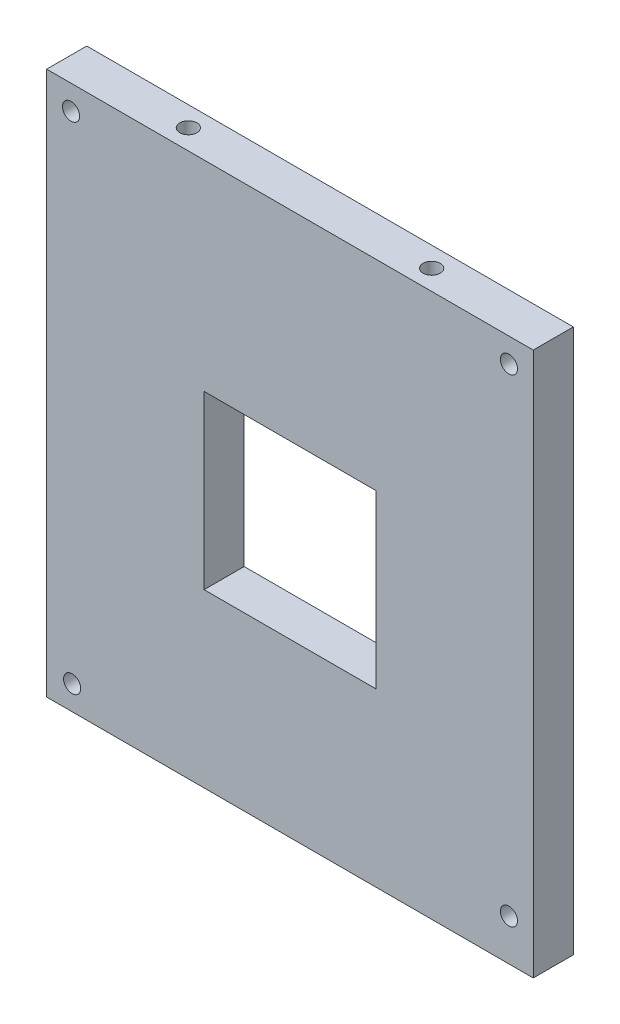
ISO-10303-21;
HEADER;
FILE_DESCRIPTION(('STEP AP214'),'2;1');
FILE_NAME('part.step','',(''),(''),'','','');
FILE_SCHEMA(('AUTOMOTIVE_DESIGN { 1 0 10303 214 1 1 1 1 }'));
ENDSEC;
DATA;
#1=APPLICATION_CONTEXT('core data for automotive mechanical design processes');
#2=APPLICATION_PROTOCOL_DEFINITION('international standard','automotive_design',2000,#1);
#3=PRODUCT_CONTEXT('',#1,'mechanical');
#4=PRODUCT('Part','Part','',(#3));
#5=PRODUCT_RELATED_PRODUCT_CATEGORY('part','',(#4));
#6=PRODUCT_DEFINITION_FORMATION('','',#4);
#7=PRODUCT_DEFINITION_CONTEXT('part definition',#1,'design');
#8=PRODUCT_DEFINITION('design','',#6,#7);
#9=PRODUCT_DEFINITION_SHAPE('','',#8);
#10=(LENGTH_UNIT() NAMED_UNIT(*) SI_UNIT(.MILLI.,.METRE.));
#11=(NAMED_UNIT(*) PLANE_ANGLE_UNIT() SI_UNIT($,.RADIAN.));
#12=(NAMED_UNIT(*) SI_UNIT($,.STERADIAN.) SOLID_ANGLE_UNIT());
#13=UNCERTAINTY_MEASURE_WITH_UNIT(LENGTH_MEASURE(1.E-05),#10,'distance_accuracy_value','');
#14=(GEOMETRIC_REPRESENTATION_CONTEXT(3) GLOBAL_UNCERTAINTY_ASSIGNED_CONTEXT((#13)) GLOBAL_UNIT_ASSIGNED_CONTEXT((#10,
#11,#12)) REPRESENTATION_CONTEXT('',''));
#15=CARTESIAN_POINT('',(0.,0.,0.));
#16=DIRECTION('',(0.,0.,1.));
#17=DIRECTION('',(1.,0.,0.));
#18=AXIS2_PLACEMENT_3D('',#15,#16,#17);
#19=CARTESIAN_POINT('',(0.,0.,7.));
#20=DIRECTION('',(1.,0.,0.));
#21=DIRECTION('',(0.,0.,-1.));
#22=AXIS2_PLACEMENT_3D('',#19,#20,#21);
#23=PLANE('',#22);
#24=DIRECTION('',(0.,-1.,0.));
#25=VECTOR('',#24,1.);
#26=CARTESIAN_POINT('',(0.,0.,0.));
#27=LINE('',#26,#25);
#28=CARTESIAN_POINT('',(0.,95.,0.));
#29=VERTEX_POINT('',#28);
#30=CARTESIAN_POINT('',(0.,0.,0.));
#31=VERTEX_POINT('',#30);
#32=EDGE_CURVE('E154',#29,#31,#27,.T.);
#33=ORIENTED_EDGE('',*,*,#32,.T.);
#34=DIRECTION('',(0.,0.,-1.));
#35=VECTOR('',#34,1.);
#36=CARTESIAN_POINT('',(0.,0.,7.));
#37=LINE('',#36,#35);
#38=CARTESIAN_POINT('',(0.,0.,7.));
#39=VERTEX_POINT('',#38);
#40=EDGE_CURVE('E11',#39,#31,#37,.T.);
#41=ORIENTED_EDGE('',*,*,#40,.F.);
#42=DIRECTION('',(0.,-1.,0.));
#43=VECTOR('',#42,1.);
#44=CARTESIAN_POINT('',(0.,0.,7.));
#45=LINE('',#44,#43);
#46=CARTESIAN_POINT('',(0.,95.,7.));
#47=VERTEX_POINT('',#46);
#48=EDGE_CURVE('E160',#47,#39,#45,.T.);
#49=ORIENTED_EDGE('',*,*,#48,.F.);
#50=DIRECTION('',(0.,0.,-1.));
#51=VECTOR('',#50,1.);
#52=CARTESIAN_POINT('',(0.,95.,7.));
#53=LINE('',#52,#51);
#54=EDGE_CURVE('E174',#47,#29,#53,.T.);
#55=ORIENTED_EDGE('',*,*,#54,.T.);
#56=EDGE_LOOP('',(#33,#41,#49,#55));
#57=FACE_BOUND('',#56,.T.);
#58=ADVANCED_FACE('F42',(#57),#23,.F.);
#59=CARTESIAN_POINT('',(0.,0.,7.));
#60=DIRECTION('',(0.,1.,0.));
#61=DIRECTION('',(0.,0.,1.));
#62=AXIS2_PLACEMENT_3D('',#59,#60,#61);
#63=PLANE('',#62);
#64=DIRECTION('',(1.,0.,0.));
#65=VECTOR('',#64,1.);
#66=CARTESIAN_POINT('',(0.,0.,0.));
#67=LINE('',#66,#65);
#68=CARTESIAN_POINT('',(85.,0.,0.));
#69=VERTEX_POINT('',#68);
#70=EDGE_CURVE('E178',#31,#69,#67,.T.);
#71=ORIENTED_EDGE('',*,*,#70,.T.);
#72=DIRECTION('',(0.,0.,-1.));
#73=VECTOR('',#72,1.);
#74=CARTESIAN_POINT('',(85.,0.,7.));
#75=LINE('',#74,#73);
#76=CARTESIAN_POINT('',(85.,0.,7.));
#77=VERTEX_POINT('',#76);
#78=EDGE_CURVE('E50',#77,#69,#75,.T.);
#79=ORIENTED_EDGE('',*,*,#78,.F.);
#80=DIRECTION('',(1.,0.,0.));
#81=VECTOR('',#80,1.);
#82=CARTESIAN_POINT('',(0.,0.,7.));
#83=LINE('',#82,#81);
#84=EDGE_CURVE('E164',#39,#77,#83,.T.);
#85=ORIENTED_EDGE('',*,*,#84,.F.);
#86=ORIENTED_EDGE('',*,*,#40,.T.);
#87=EDGE_LOOP('',(#71,#79,#85,#86));
#88=FACE_BOUND('',#87,.T.);
#89=ADVANCED_FACE('F212',(#88),#63,.F.);
#90=CARTESIAN_POINT('',(85.,0.,7.));
#91=DIRECTION('',(-1.,0.,0.));
#92=DIRECTION('',(0.,0.,1.));
#93=AXIS2_PLACEMENT_3D('',#90,#91,#92);
#94=PLANE('',#93);
#95=DIRECTION('',(0.,1.,0.));
#96=VECTOR('',#95,1.);
#97=CARTESIAN_POINT('',(85.,0.,0.));
#98=LINE('',#97,#96);
#99=CARTESIAN_POINT('',(85.,95.,0.));
#100=VERTEX_POINT('',#99);
#101=EDGE_CURVE('E181',#69,#100,#98,.T.);
#102=ORIENTED_EDGE('',*,*,#101,.T.);
#103=DIRECTION('',(0.,0.,-1.));
#104=VECTOR('',#103,1.);
#105=CARTESIAN_POINT('',(85.,95.,7.));
#106=LINE('',#105,#104);
#107=CARTESIAN_POINT('',(85.,95.,7.));
#108=VERTEX_POINT('',#107);
#109=EDGE_CURVE('E189',#108,#100,#106,.T.);
#110=ORIENTED_EDGE('',*,*,#109,.F.);
#111=DIRECTION('',(0.,1.,0.));
#112=VECTOR('',#111,1.);
#113=CARTESIAN_POINT('',(85.,0.,7.));
#114=LINE('',#113,#112);
#115=EDGE_CURVE('E168',#77,#108,#114,.T.);
#116=ORIENTED_EDGE('',*,*,#115,.F.);
#117=ORIENTED_EDGE('',*,*,#78,.T.);
#118=EDGE_LOOP('',(#102,#110,#116,#117));
#119=FACE_BOUND('',#118,.T.);
#120=ADVANCED_FACE('F198',(#119),#94,.F.);
#121=CARTESIAN_POINT('',(0.,95.,7.));
#122=DIRECTION('',(0.,-1.,0.));
#123=DIRECTION('',(0.,0.,-1.));
#124=AXIS2_PLACEMENT_3D('',#121,#122,#123);
#125=PLANE('',#124);
#126=CARTESIAN_POINT('',(21.25,95.,3.5));
#127=DIRECTION('',(0.,1.,0.));
#128=DIRECTION('',(0.,0.,1.));
#129=AXIS2_PLACEMENT_3D('',#126,#127,#128);
#130=CIRCLE('',#129,1.5);
#131=CARTESIAN_POINT('',(21.25,95.,5.));
#132=VERTEX_POINT('',#131);
#133=EDGE_CURVE('E301',#132,#132,#130,.T.);
#134=ORIENTED_EDGE('',*,*,#133,.F.);
#135=EDGE_LOOP('',(#134));
#136=FACE_BOUND('',#135,.T.);
#137=CARTESIAN_POINT('',(63.75,95.,3.5));
#138=DIRECTION('',(0.,1.,0.));
#139=DIRECTION('',(0.,0.,1.));
#140=AXIS2_PLACEMENT_3D('',#137,#138,#139);
#141=CIRCLE('',#140,1.5);
#142=CARTESIAN_POINT('',(63.75,95.,5.));
#143=VERTEX_POINT('',#142);
#144=EDGE_CURVE('E304',#143,#143,#141,.T.);
#145=ORIENTED_EDGE('',*,*,#144,.F.);
#146=EDGE_LOOP('',(#145));
#147=FACE_BOUND('',#146,.T.);
#148=DIRECTION('',(-1.,0.,0.));
#149=VECTOR('',#148,1.);
#150=CARTESIAN_POINT('',(0.,95.,0.));
#151=LINE('',#150,#149);
#152=EDGE_CURVE('E165',#100,#29,#151,.T.);
#153=ORIENTED_EDGE('',*,*,#152,.T.);
#154=ORIENTED_EDGE('',*,*,#54,.F.);
#155=DIRECTION('',(-1.,0.,0.));
#156=VECTOR('',#155,1.);
#157=CARTESIAN_POINT('',(0.,95.,7.));
#158=LINE('',#157,#156);
#159=EDGE_CURVE('E171',#108,#47,#158,.T.);
#160=ORIENTED_EDGE('',*,*,#159,.F.);
#161=ORIENTED_EDGE('',*,*,#109,.T.);
#162=EDGE_LOOP('',(#153,#154,#160,#161));
#163=FACE_BOUND('',#162,.T.);
#164=ADVANCED_FACE('F205',(#136,#147,#163),#125,.F.);
#165=CARTESIAN_POINT('',(0.,0.,7.));
#166=DIRECTION('',(0.,0.,-1.));
#167=DIRECTION('',(-1.,0.,0.));
#168=AXIS2_PLACEMENT_3D('',#165,#166,#167);
#169=PLANE('',#168);
#170=CARTESIAN_POINT('',(80.75,7.25,7.));
#171=DIRECTION('',(0.,0.,-1.));
#172=DIRECTION('',(-1.,0.,0.));
#173=AXIS2_PLACEMENT_3D('',#170,#171,#172);
#174=CIRCLE('',#173,1.5);
#175=CARTESIAN_POINT('',(79.25,7.25,7.));
#176=VERTEX_POINT('',#175);
#177=EDGE_CURVE('E288',#176,#176,#174,.T.);
#178=ORIENTED_EDGE('',*,*,#177,.T.);
#179=EDGE_LOOP('',(#178));
#180=FACE_BOUND('',#179,.T.);
#181=CARTESIAN_POINT('',(4.45,4.25,7.));
#182=DIRECTION('',(0.,0.,-1.));
#183=DIRECTION('',(-1.,0.,0.));
#184=AXIS2_PLACEMENT_3D('',#181,#182,#183);
#185=CIRCLE('',#184,1.5);
#186=CARTESIAN_POINT('',(2.95,4.25,7.));
#187=VERTEX_POINT('',#186);
#188=EDGE_CURVE('E282',#187,#187,#185,.T.);
#189=ORIENTED_EDGE('',*,*,#188,.T.);
#190=EDGE_LOOP('',(#189));
#191=FACE_BOUND('',#190,.T.);
#192=CARTESIAN_POINT('',(4.24999999999999,90.75,7.));
#193=DIRECTION('',(0.,0.,-1.));
#194=DIRECTION('',(-1.,0.,0.));
#195=AXIS2_PLACEMENT_3D('',#192,#193,#194);
#196=CIRCLE('',#195,1.5);
#197=CARTESIAN_POINT('',(2.74999999999999,90.75,7.));
#198=VERTEX_POINT('',#197);
#199=EDGE_CURVE('E279',#198,#198,#196,.T.);
#200=ORIENTED_EDGE('',*,*,#199,.T.);
#201=EDGE_LOOP('',(#200));
#202=FACE_BOUND('',#201,.T.);
#203=CARTESIAN_POINT('',(80.75,90.75,7.));
#204=DIRECTION('',(0.,0.,-1.));
#205=DIRECTION('',(-1.,0.,0.));
#206=AXIS2_PLACEMENT_3D('',#203,#204,#205);
#207=CIRCLE('',#206,1.5);
#208=CARTESIAN_POINT('',(79.25,90.75,7.));
#209=VERTEX_POINT('',#208);
#210=EDGE_CURVE('E283',#209,#209,#207,.T.);
#211=ORIENTED_EDGE('',*,*,#210,.T.);
#212=EDGE_LOOP('',(#211));
#213=FACE_BOUND('',#212,.T.);
#214=DIRECTION('',(-1.,0.,0.));
#215=VECTOR('',#214,1.);
#216=CARTESIAN_POINT('',(27.5,60.,7.));
#217=LINE('',#216,#215);
#218=CARTESIAN_POINT('',(57.5,60.,7.));
#219=VERTEX_POINT('',#218);
#220=CARTESIAN_POINT('',(27.5,60.,7.));
#221=VERTEX_POINT('',#220);
#222=EDGE_CURVE('E144',#219,#221,#217,.T.);
#223=ORIENTED_EDGE('',*,*,#222,.F.);
#224=DIRECTION('',(0.,1.,0.));
#225=VECTOR('',#224,1.);
#226=CARTESIAN_POINT('',(57.5,30.,7.));
#227=LINE('',#226,#225);
#228=CARTESIAN_POINT('',(57.5,30.,7.));
#229=VERTEX_POINT('',#228);
#230=EDGE_CURVE('E57',#229,#219,#227,.T.);
#231=ORIENTED_EDGE('',*,*,#230,.F.);
#232=DIRECTION('',(1.,0.,0.));
#233=VECTOR('',#232,1.);
#234=CARTESIAN_POINT('',(27.5,30.,7.));
#235=LINE('',#234,#233);
#236=CARTESIAN_POINT('',(27.5,30.,7.));
#237=VERTEX_POINT('',#236);
#238=EDGE_CURVE('E128',#237,#229,#235,.T.);
#239=ORIENTED_EDGE('',*,*,#238,.F.);
#240=DIRECTION('',(0.,-1.,0.));
#241=VECTOR('',#240,1.);
#242=CARTESIAN_POINT('',(27.5,30.,7.));
#243=LINE('',#242,#241);
#244=EDGE_CURVE('E132',#221,#237,#243,.T.);
#245=ORIENTED_EDGE('',*,*,#244,.F.);
#246=EDGE_LOOP('',(#223,#231,#239,#245));
#247=FACE_BOUND('',#246,.T.);
#248=ORIENTED_EDGE('',*,*,#48,.T.);
#249=ORIENTED_EDGE('',*,*,#84,.T.);
#250=ORIENTED_EDGE('',*,*,#115,.T.);
#251=ORIENTED_EDGE('',*,*,#159,.T.);
#252=EDGE_LOOP('',(#248,#249,#250,#251));
#253=FACE_BOUND('',#252,.T.);
#254=ADVANCED_FACE('F211',(#180,#191,#202,#213,#247,#253),#169,.F.);
#255=CARTESIAN_POINT('',(0.,0.,0.));
#256=DIRECTION('',(0.,0.,-1.));
#257=DIRECTION('',(-1.,0.,0.));
#258=AXIS2_PLACEMENT_3D('',#255,#256,#257);
#259=PLANE('',#258);
#260=CARTESIAN_POINT('',(80.75,7.25,0.));
#261=DIRECTION('',(0.,0.,-1.));
#262=DIRECTION('',(-1.,0.,0.));
#263=AXIS2_PLACEMENT_3D('',#260,#261,#262);
#264=CIRCLE('',#263,1.5);
#265=CARTESIAN_POINT('',(79.25,7.25,0.));
#266=VERTEX_POINT('',#265);
#267=EDGE_CURVE('E330',#266,#266,#264,.T.);
#268=ORIENTED_EDGE('',*,*,#267,.F.);
#269=EDGE_LOOP('',(#268));
#270=FACE_BOUND('',#269,.T.);
#271=CARTESIAN_POINT('',(4.45,4.25,0.));
#272=DIRECTION('',(0.,0.,-1.));
#273=DIRECTION('',(-1.,0.,0.));
#274=AXIS2_PLACEMENT_3D('',#271,#272,#273);
#275=CIRCLE('',#274,1.5);
#276=CARTESIAN_POINT('',(2.95,4.25,0.));
#277=VERTEX_POINT('',#276);
#278=EDGE_CURVE('E334',#277,#277,#275,.T.);
#279=ORIENTED_EDGE('',*,*,#278,.F.);
#280=EDGE_LOOP('',(#279));
#281=FACE_BOUND('',#280,.T.);
#282=CARTESIAN_POINT('',(4.24999999999999,90.75,0.));
#283=DIRECTION('',(0.,0.,-1.));
#284=DIRECTION('',(1.,0.,0.));
#285=AXIS2_PLACEMENT_3D('',#282,#283,#284);
#286=CIRCLE('',#285,1.5);
#287=CARTESIAN_POINT('',(5.74999999999999,90.75,0.));
#288=VERTEX_POINT('',#287);
#289=EDGE_CURVE('E276',#288,#288,#286,.T.);
#290=ORIENTED_EDGE('',*,*,#289,.F.);
#291=EDGE_LOOP('',(#290));
#292=FACE_BOUND('',#291,.T.);
#293=CARTESIAN_POINT('',(80.75,90.75,0.));
#294=DIRECTION('',(0.,0.,-1.));
#295=DIRECTION('',(-1.,0.,0.));
#296=AXIS2_PLACEMENT_3D('',#293,#294,#295);
#297=CIRCLE('',#296,1.5);
#298=CARTESIAN_POINT('',(79.25,90.75,0.));
#299=VERTEX_POINT('',#298);
#300=EDGE_CURVE('E291',#299,#299,#297,.T.);
#301=ORIENTED_EDGE('',*,*,#300,.F.);
#302=EDGE_LOOP('',(#301));
#303=FACE_BOUND('',#302,.T.);
#304=DIRECTION('',(0.,1.,0.));
#305=VECTOR('',#304,1.);
#306=CARTESIAN_POINT('',(57.5,30.,0.));
#307=LINE('',#306,#305);
#308=CARTESIAN_POINT('',(57.5,30.,0.));
#309=VERTEX_POINT('',#308);
#310=CARTESIAN_POINT('',(57.5,60.,0.));
#311=VERTEX_POINT('',#310);
#312=EDGE_CURVE('E109',#309,#311,#307,.T.);
#313=ORIENTED_EDGE('',*,*,#312,.T.);
#314=DIRECTION('',(-1.,0.,0.));
#315=VECTOR('',#314,1.);
#316=CARTESIAN_POINT('',(27.5,60.,0.));
#317=LINE('',#316,#315);
#318=CARTESIAN_POINT('',(27.5,60.,0.));
#319=VERTEX_POINT('',#318);
#320=EDGE_CURVE('E119',#311,#319,#317,.T.);
#321=ORIENTED_EDGE('',*,*,#320,.T.);
#322=DIRECTION('',(0.,-1.,0.));
#323=VECTOR('',#322,1.);
#324=CARTESIAN_POINT('',(27.5,30.,0.));
#325=LINE('',#324,#323);
#326=CARTESIAN_POINT('',(27.5,30.,0.));
#327=VERTEX_POINT('',#326);
#328=EDGE_CURVE('E65',#319,#327,#325,.T.);
#329=ORIENTED_EDGE('',*,*,#328,.T.);
#330=DIRECTION('',(1.,0.,0.));
#331=VECTOR('',#330,1.);
#332=CARTESIAN_POINT('',(27.5,30.,0.));
#333=LINE('',#332,#331);
#334=EDGE_CURVE('E116',#327,#309,#333,.T.);
#335=ORIENTED_EDGE('',*,*,#334,.T.);
#336=EDGE_LOOP('',(#313,#321,#329,#335));
#337=FACE_BOUND('',#336,.T.);
#338=ORIENTED_EDGE('',*,*,#32,.F.);
#339=ORIENTED_EDGE('',*,*,#152,.F.);
#340=ORIENTED_EDGE('',*,*,#101,.F.);
#341=ORIENTED_EDGE('',*,*,#70,.F.);
#342=EDGE_LOOP('',(#338,#339,#340,#341));
#343=FACE_BOUND('',#342,.T.);
#344=ADVANCED_FACE('F124',(#270,#281,#292,#303,#337,#343),#259,.T.);
#345=CARTESIAN_POINT('',(57.5,30.,0.));
#346=DIRECTION('',(1.,0.,0.));
#347=DIRECTION('',(0.,0.,-1.));
#348=AXIS2_PLACEMENT_3D('',#345,#346,#347);
#349=PLANE('',#348);
#350=ORIENTED_EDGE('',*,*,#230,.T.);
#351=DIRECTION('',(0.,0.,1.));
#352=VECTOR('',#351,1.);
#353=CARTESIAN_POINT('',(57.5,60.,0.));
#354=LINE('',#353,#352);
#355=EDGE_CURVE('E105',#311,#219,#354,.T.);
#356=ORIENTED_EDGE('',*,*,#355,.F.);
#357=ORIENTED_EDGE('',*,*,#312,.F.);
#358=DIRECTION('',(0.,0.,1.));
#359=VECTOR('',#358,1.);
#360=CARTESIAN_POINT('',(57.5,30.,0.));
#361=LINE('',#360,#359);
#362=EDGE_CURVE('E151',#309,#229,#361,.T.);
#363=ORIENTED_EDGE('',*,*,#362,.T.);
#364=EDGE_LOOP('',(#350,#356,#357,#363));
#365=FACE_BOUND('',#364,.T.);
#366=ADVANCED_FACE('F107',(#365),#349,.F.);
#367=CARTESIAN_POINT('',(27.5,30.,0.));
#368=DIRECTION('',(0.,-1.,0.));
#369=DIRECTION('',(0.,0.,-1.));
#370=AXIS2_PLACEMENT_3D('',#367,#368,#369);
#371=PLANE('',#370);
#372=ORIENTED_EDGE('',*,*,#238,.T.);
#373=ORIENTED_EDGE('',*,*,#362,.F.);
#374=ORIENTED_EDGE('',*,*,#334,.F.);
#375=DIRECTION('',(0.,0.,1.));
#376=VECTOR('',#375,1.);
#377=CARTESIAN_POINT('',(27.5,30.,0.));
#378=LINE('',#377,#376);
#379=EDGE_CURVE('E155',#327,#237,#378,.T.);
#380=ORIENTED_EDGE('',*,*,#379,.T.);
#381=EDGE_LOOP('',(#372,#373,#374,#380));
#382=FACE_BOUND('',#381,.T.);
#383=ADVANCED_FACE('F231',(#382),#371,.F.);
#384=CARTESIAN_POINT('',(27.5,30.,0.));
#385=DIRECTION('',(-1.,0.,0.));
#386=DIRECTION('',(0.,0.,1.));
#387=AXIS2_PLACEMENT_3D('',#384,#385,#386);
#388=PLANE('',#387);
#389=ORIENTED_EDGE('',*,*,#244,.T.);
#390=ORIENTED_EDGE('',*,*,#379,.F.);
#391=ORIENTED_EDGE('',*,*,#328,.F.);
#392=DIRECTION('',(0.,0.,1.));
#393=VECTOR('',#392,1.);
#394=CARTESIAN_POINT('',(27.5,60.,0.));
#395=LINE('',#394,#393);
#396=EDGE_CURVE('E115',#319,#221,#395,.T.);
#397=ORIENTED_EDGE('',*,*,#396,.T.);
#398=EDGE_LOOP('',(#389,#390,#391,#397));
#399=FACE_BOUND('',#398,.T.);
#400=ADVANCED_FACE('F235',(#399),#388,.F.);
#401=CARTESIAN_POINT('',(27.5,60.,0.));
#402=DIRECTION('',(0.,1.,0.));
#403=DIRECTION('',(0.,0.,1.));
#404=AXIS2_PLACEMENT_3D('',#401,#402,#403);
#405=PLANE('',#404);
#406=ORIENTED_EDGE('',*,*,#222,.T.);
#407=ORIENTED_EDGE('',*,*,#396,.F.);
#408=ORIENTED_EDGE('',*,*,#320,.F.);
#409=ORIENTED_EDGE('',*,*,#355,.T.);
#410=EDGE_LOOP('',(#406,#407,#408,#409));
#411=FACE_BOUND('',#410,.T.);
#412=ADVANCED_FACE('F120',(#411),#405,.F.);
#413=CARTESIAN_POINT('',(63.75,90.,3.5));
#414=DIRECTION('',(0.,1.,0.));
#415=DIRECTION('',(0.,0.,1.));
#416=AXIS2_PLACEMENT_3D('',#413,#414,#415);
#417=CYLINDRICAL_SURFACE('',#416,1.5);
#418=CARTESIAN_POINT('',(63.75,90.,3.5));
#419=DIRECTION('',(0.,1.,0.));
#420=DIRECTION('',(0.,0.,1.));
#421=AXIS2_PLACEMENT_3D('',#418,#419,#420);
#422=CIRCLE('',#421,1.5);
#423=CARTESIAN_POINT('',(63.75,90.,5.));
#424=VERTEX_POINT('',#423);
#425=EDGE_CURVE('E135',#424,#424,#422,.T.);
#426=ORIENTED_EDGE('',*,*,#425,.F.);
#427=EDGE_LOOP('',(#426));
#428=FACE_BOUND('',#427,.T.);
#429=ORIENTED_EDGE('',*,*,#144,.T.);
#430=EDGE_LOOP('',(#429));
#431=FACE_BOUND('',#430,.T.);
#432=ADVANCED_FACE('F234',(#428,#431),#417,.F.);
#433=CARTESIAN_POINT('',(63.75,90.,3.5));
#434=DIRECTION('',(0.,1.,0.));
#435=DIRECTION('',(0.,0.,1.));
#436=AXIS2_PLACEMENT_3D('',#433,#434,#435);
#437=PLANE('',#436);
#438=ORIENTED_EDGE('',*,*,#425,.T.);
#439=EDGE_LOOP('',(#438));
#440=FACE_BOUND('',#439,.T.);
#441=ADVANCED_FACE('F241',(#440),#437,.T.);
#442=CARTESIAN_POINT('',(21.25,90.,3.5));
#443=DIRECTION('',(0.,1.,0.));
#444=DIRECTION('',(0.,0.,1.));
#445=AXIS2_PLACEMENT_3D('',#442,#443,#444);
#446=CYLINDRICAL_SURFACE('',#445,1.5);
#447=CARTESIAN_POINT('',(21.25,90.,3.5));
#448=DIRECTION('',(0.,1.,0.));
#449=DIRECTION('',(0.,0.,1.));
#450=AXIS2_PLACEMENT_3D('',#447,#448,#449);
#451=CIRCLE('',#450,1.5);
#452=CARTESIAN_POINT('',(21.25,90.,5.));
#453=VERTEX_POINT('',#452);
#454=EDGE_CURVE('E145',#453,#453,#451,.T.);
#455=ORIENTED_EDGE('',*,*,#454,.F.);
#456=EDGE_LOOP('',(#455));
#457=FACE_BOUND('',#456,.T.);
#458=ORIENTED_EDGE('',*,*,#133,.T.);
#459=EDGE_LOOP('',(#458));
#460=FACE_BOUND('',#459,.T.);
#461=ADVANCED_FACE('F244',(#457,#460),#446,.F.);
#462=CARTESIAN_POINT('',(21.25,90.,3.5));
#463=DIRECTION('',(0.,1.,0.));
#464=DIRECTION('',(0.,0.,1.));
#465=AXIS2_PLACEMENT_3D('',#462,#463,#464);
#466=PLANE('',#465);
#467=ORIENTED_EDGE('',*,*,#454,.T.);
#468=EDGE_LOOP('',(#467));
#469=FACE_BOUND('',#468,.T.);
#470=ADVANCED_FACE('F251',(#469),#466,.T.);
#471=CARTESIAN_POINT('',(80.75,90.75,8.));
#472=DIRECTION('',(0.,0.,-1.));
#473=DIRECTION('',(-1.,0.,0.));
#474=AXIS2_PLACEMENT_3D('',#471,#472,#473);
#475=CYLINDRICAL_SURFACE('',#474,1.5);
#476=ORIENTED_EDGE('',*,*,#300,.T.);
#477=EDGE_LOOP('',(#476));
#478=FACE_BOUND('',#477,.T.);
#479=ORIENTED_EDGE('',*,*,#210,.F.);
#480=EDGE_LOOP('',(#479));
#481=FACE_BOUND('',#480,.T.);
#482=ADVANCED_FACE('F255',(#478,#481),#475,.F.);
#483=CARTESIAN_POINT('',(4.24999999999999,90.75,8.));
#484=DIRECTION('',(0.,0.,-1.));
#485=DIRECTION('',(-1.,0.,0.));
#486=AXIS2_PLACEMENT_3D('',#483,#484,#485);
#487=CYLINDRICAL_SURFACE('',#486,1.5);
#488=ORIENTED_EDGE('',*,*,#289,.T.);
#489=EDGE_LOOP('',(#488));
#490=FACE_BOUND('',#489,.T.);
#491=ORIENTED_EDGE('',*,*,#199,.F.);
#492=EDGE_LOOP('',(#491));
#493=FACE_BOUND('',#492,.T.);
#494=ADVANCED_FACE('F259',(#490,#493),#487,.F.);
#495=CARTESIAN_POINT('',(4.45,4.25,8.));
#496=DIRECTION('',(0.,0.,-1.));
#497=DIRECTION('',(-1.,0.,0.));
#498=AXIS2_PLACEMENT_3D('',#495,#496,#497);
#499=CYLINDRICAL_SURFACE('',#498,1.5);
#500=ORIENTED_EDGE('',*,*,#278,.T.);
#501=EDGE_LOOP('',(#500));
#502=FACE_BOUND('',#501,.T.);
#503=ORIENTED_EDGE('',*,*,#188,.F.);
#504=EDGE_LOOP('',(#503));
#505=FACE_BOUND('',#504,.T.);
#506=ADVANCED_FACE('F264',(#502,#505),#499,.F.);
#507=CARTESIAN_POINT('',(80.75,7.25,8.));
#508=DIRECTION('',(0.,0.,-1.));
#509=DIRECTION('',(-1.,0.,0.));
#510=AXIS2_PLACEMENT_3D('',#507,#508,#509);
#511=CYLINDRICAL_SURFACE('',#510,1.5);
#512=ORIENTED_EDGE('',*,*,#267,.T.);
#513=EDGE_LOOP('',(#512));
#514=FACE_BOUND('',#513,.T.);
#515=ORIENTED_EDGE('',*,*,#177,.F.);
#516=EDGE_LOOP('',(#515));
#517=FACE_BOUND('',#516,.T.);
#518=ADVANCED_FACE('F261',(#514,#517),#511,.F.);
#519=CLOSED_SHELL('',(#58,#89,#120,#164,#254,#344,#366,#383,#400,#412,#432,#441,#461,#470,#482,
#494,#506,#518));
#520=MANIFOLD_SOLID_BREP('B2',#519);
#521=ADVANCED_BREP_SHAPE_REPRESENTATION('',(#18,#520),#14);
#522=SHAPE_DEFINITION_REPRESENTATION(#9,#521);
ENDSEC;
END-ISO-10303-21;
